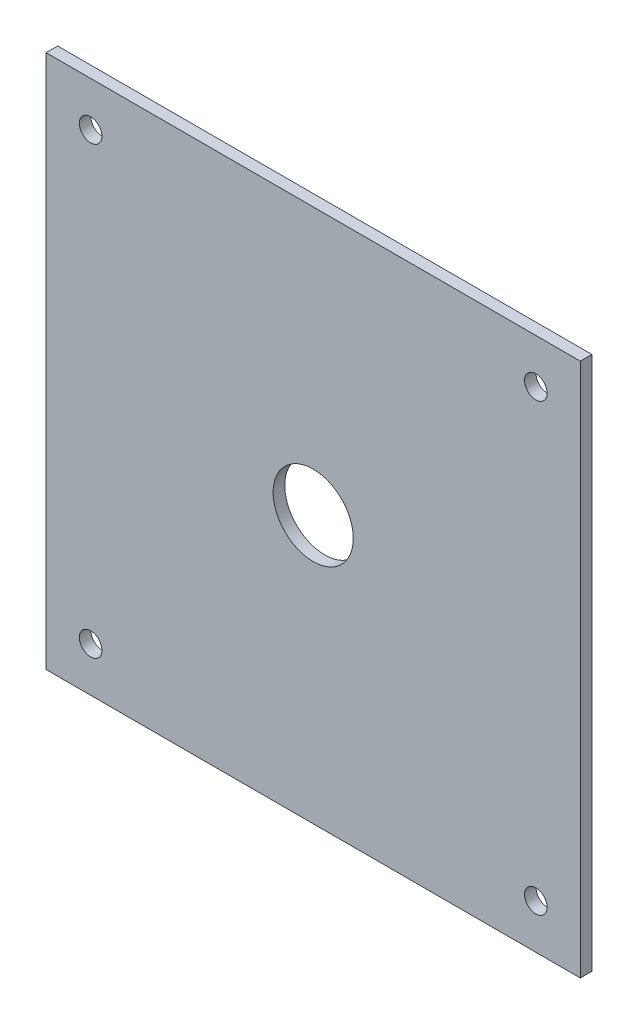
ISO-10303-21;
HEADER;
FILE_DESCRIPTION(('STEP AP214'),'2;1');
FILE_NAME('part.step','',(''),(''),'','','');
FILE_SCHEMA(('AUTOMOTIVE_DESIGN { 1 0 10303 214 1 1 1 1 }'));
ENDSEC;
DATA;
#1=APPLICATION_CONTEXT('core data for automotive mechanical design processes');
#2=APPLICATION_PROTOCOL_DEFINITION('international standard','automotive_design',2000,#1);
#3=PRODUCT_CONTEXT('',#1,'mechanical');
#4=PRODUCT('Part','Part','',(#3));
#5=PRODUCT_RELATED_PRODUCT_CATEGORY('part','',(#4));
#6=PRODUCT_DEFINITION_FORMATION('','',#4);
#7=PRODUCT_DEFINITION_CONTEXT('part definition',#1,'design');
#8=PRODUCT_DEFINITION('design','',#6,#7);
#9=PRODUCT_DEFINITION_SHAPE('','',#8);
#10=(LENGTH_UNIT() NAMED_UNIT(*) SI_UNIT(.MILLI.,.METRE.));
#11=(NAMED_UNIT(*) PLANE_ANGLE_UNIT() SI_UNIT($,.RADIAN.));
#12=(NAMED_UNIT(*) SI_UNIT($,.STERADIAN.) SOLID_ANGLE_UNIT());
#13=UNCERTAINTY_MEASURE_WITH_UNIT(LENGTH_MEASURE(1.E-05),#10,'distance_accuracy_value','');
#14=(GEOMETRIC_REPRESENTATION_CONTEXT(3) GLOBAL_UNCERTAINTY_ASSIGNED_CONTEXT((#13)) GLOBAL_UNIT_ASSIGNED_CONTEXT((#10,
#11,#12)) REPRESENTATION_CONTEXT('',''));
#15=CARTESIAN_POINT('',(0.,0.,0.));
#16=DIRECTION('',(0.,0.,1.));
#17=DIRECTION('',(1.,0.,0.));
#18=AXIS2_PLACEMENT_3D('',#15,#16,#17);
#19=CARTESIAN_POINT('',(0.,0.,3.302));
#20=DIRECTION('',(0.,0.,-1.));
#21=DIRECTION('',(-1.,0.,0.));
#22=AXIS2_PLACEMENT_3D('',#19,#20,#21);
#23=PLANE('',#22);
#24=DIRECTION('',(0.,1.,0.));
#25=VECTOR('',#24,1.);
#26=CARTESIAN_POINT('',(76.2,-76.2,3.302));
#27=LINE('',#26,#25);
#28=CARTESIAN_POINT('',(76.2,-76.2,3.302));
#29=VERTEX_POINT('',#28);
#30=CARTESIAN_POINT('',(76.2,76.2,3.302));
#31=VERTEX_POINT('',#30);
#32=EDGE_CURVE('E98',#29,#31,#27,.T.);
#33=ORIENTED_EDGE('',*,*,#32,.T.);
#34=DIRECTION('',(-1.,0.,0.));
#35=VECTOR('',#34,1.);
#36=CARTESIAN_POINT('',(-76.2,76.2,3.302));
#37=LINE('',#36,#35);
#38=CARTESIAN_POINT('',(-76.2,76.2,3.302));
#39=VERTEX_POINT('',#38);
#40=EDGE_CURVE('E93',#31,#39,#37,.T.);
#41=ORIENTED_EDGE('',*,*,#40,.T.);
#42=DIRECTION('',(0.,-1.,0.));
#43=VECTOR('',#42,1.);
#44=CARTESIAN_POINT('',(-76.2,-76.2,3.302));
#45=LINE('',#44,#43);
#46=CARTESIAN_POINT('',(-76.2,-76.2,3.302));
#47=VERTEX_POINT('',#46);
#48=EDGE_CURVE('E96',#39,#47,#45,.T.);
#49=ORIENTED_EDGE('',*,*,#48,.T.);
#50=DIRECTION('',(1.,0.,0.));
#51=VECTOR('',#50,1.);
#52=CARTESIAN_POINT('',(-76.2,-76.2,3.302));
#53=LINE('',#52,#51);
#54=EDGE_CURVE('E63',#47,#29,#53,.T.);
#55=ORIENTED_EDGE('',*,*,#54,.T.);
#56=EDGE_LOOP('',(#33,#41,#49,#55));
#57=FACE_BOUND('',#56,.T.);
#58=CARTESIAN_POINT('',(0.,0.,3.302));
#59=DIRECTION('',(0.,0.,1.));
#60=DIRECTION('',(1.,0.,0.));
#61=AXIS2_PLACEMENT_3D('',#58,#59,#60);
#62=CIRCLE('',#61,11.43);
#63=CARTESIAN_POINT('',(11.43,0.,3.302));
#64=VERTEX_POINT('',#63);
#65=EDGE_CURVE('E118',#64,#64,#62,.T.);
#66=ORIENTED_EDGE('',*,*,#65,.F.);
#67=EDGE_LOOP('',(#66));
#68=FACE_BOUND('',#67,.T.);
#69=CARTESIAN_POINT('',(-63.5,63.5,3.302));
#70=DIRECTION('',(0.,0.,1.));
#71=DIRECTION('',(1.,0.,0.));
#72=AXIS2_PLACEMENT_3D('',#69,#70,#71);
#73=CIRCLE('',#72,3.2258);
#74=CARTESIAN_POINT('',(-60.2742,63.5,3.302));
#75=VERTEX_POINT('',#74);
#76=EDGE_CURVE('E140',#75,#75,#73,.T.);
#77=ORIENTED_EDGE('',*,*,#76,.F.);
#78=EDGE_LOOP('',(#77));
#79=FACE_BOUND('',#78,.T.);
#80=CARTESIAN_POINT('',(63.5000000000007,63.5000000000004,3.302));
#81=DIRECTION('',(0.,0.,1.));
#82=DIRECTION('',(-1.,0.,0.));
#83=AXIS2_PLACEMENT_3D('',#80,#81,#82);
#84=CIRCLE('',#83,3.22579999999999);
#85=CARTESIAN_POINT('',(60.2742000000007,63.5000000000004,3.302));
#86=VERTEX_POINT('',#85);
#87=EDGE_CURVE('E148',#86,#86,#84,.T.);
#88=ORIENTED_EDGE('',*,*,#87,.F.);
#89=EDGE_LOOP('',(#88));
#90=FACE_BOUND('',#89,.T.);
#91=CARTESIAN_POINT('',(63.5000000000007,-63.5000000000005,3.302));
#92=DIRECTION('',(0.,0.,1.));
#93=DIRECTION('',(1.,0.,0.));
#94=AXIS2_PLACEMENT_3D('',#91,#92,#93);
#95=CIRCLE('',#94,3.22579999999999);
#96=CARTESIAN_POINT('',(66.7258000000007,-63.5000000000005,3.302));
#97=VERTEX_POINT('',#96);
#98=EDGE_CURVE('E156',#97,#97,#95,.T.);
#99=ORIENTED_EDGE('',*,*,#98,.F.);
#100=EDGE_LOOP('',(#99));
#101=FACE_BOUND('',#100,.T.);
#102=CARTESIAN_POINT('',(-63.5,-63.5,3.302));
#103=DIRECTION('',(0.,0.,1.));
#104=DIRECTION('',(-1.,0.,0.));
#105=AXIS2_PLACEMENT_3D('',#102,#103,#104);
#106=CIRCLE('',#105,3.2258);
#107=CARTESIAN_POINT('',(-66.7258,-63.5,3.302));
#108=VERTEX_POINT('',#107);
#109=EDGE_CURVE('E164',#108,#108,#106,.T.);
#110=ORIENTED_EDGE('',*,*,#109,.F.);
#111=EDGE_LOOP('',(#110));
#112=FACE_BOUND('',#111,.T.);
#113=ADVANCED_FACE('F45',(#57,#68,#79,#90,#101,#112),#23,.F.);
#114=CARTESIAN_POINT('',(0.,0.,0.));
#115=DIRECTION('',(0.,0.,-1.));
#116=DIRECTION('',(-1.,0.,0.));
#117=AXIS2_PLACEMENT_3D('',#114,#115,#116);
#118=PLANE('',#117);
#119=CARTESIAN_POINT('',(63.5000000000007,-63.5000000000005,0.));
#120=DIRECTION('',(0.,0.,1.));
#121=DIRECTION('',(1.,0.,0.));
#122=AXIS2_PLACEMENT_3D('',#119,#120,#121);
#123=CIRCLE('',#122,3.22579999999999);
#124=CARTESIAN_POINT('',(66.7258000000007,-63.5000000000005,0.));
#125=VERTEX_POINT('',#124);
#126=EDGE_CURVE('E160',#125,#125,#123,.T.);
#127=ORIENTED_EDGE('',*,*,#126,.T.);
#128=EDGE_LOOP('',(#127));
#129=FACE_BOUND('',#128,.T.);
#130=CARTESIAN_POINT('',(-63.5,63.5,0.));
#131=DIRECTION('',(0.,0.,1.));
#132=DIRECTION('',(1.,0.,0.));
#133=AXIS2_PLACEMENT_3D('',#130,#131,#132);
#134=CIRCLE('',#133,3.2258);
#135=CARTESIAN_POINT('',(-60.2742,63.5,0.));
#136=VERTEX_POINT('',#135);
#137=EDGE_CURVE('E144',#136,#136,#134,.T.);
#138=ORIENTED_EDGE('',*,*,#137,.T.);
#139=EDGE_LOOP('',(#138));
#140=FACE_BOUND('',#139,.T.);
#141=DIRECTION('',(0.,1.,0.));
#142=VECTOR('',#141,1.);
#143=CARTESIAN_POINT('',(76.2,-76.2,0.));
#144=LINE('',#143,#142);
#145=CARTESIAN_POINT('',(76.2,-76.2,0.));
#146=VERTEX_POINT('',#145);
#147=CARTESIAN_POINT('',(76.2,76.2,0.));
#148=VERTEX_POINT('',#147);
#149=EDGE_CURVE('E114',#146,#148,#144,.T.);
#150=ORIENTED_EDGE('',*,*,#149,.F.);
#151=DIRECTION('',(1.,0.,0.));
#152=VECTOR('',#151,1.);
#153=CARTESIAN_POINT('',(-76.2,-76.2,0.));
#154=LINE('',#153,#152);
#155=CARTESIAN_POINT('',(-76.2,-76.2,0.));
#156=VERTEX_POINT('',#155);
#157=EDGE_CURVE('E86',#156,#146,#154,.T.);
#158=ORIENTED_EDGE('',*,*,#157,.F.);
#159=DIRECTION('',(0.,-1.,0.));
#160=VECTOR('',#159,1.);
#161=CARTESIAN_POINT('',(-76.2,-76.2,0.));
#162=LINE('',#161,#160);
#163=CARTESIAN_POINT('',(-76.2,76.2,0.));
#164=VERTEX_POINT('',#163);
#165=EDGE_CURVE('E80',#164,#156,#162,.T.);
#166=ORIENTED_EDGE('',*,*,#165,.F.);
#167=DIRECTION('',(-1.,0.,0.));
#168=VECTOR('',#167,1.);
#169=CARTESIAN_POINT('',(-76.2,76.2,0.));
#170=LINE('',#169,#168);
#171=EDGE_CURVE('E103',#148,#164,#170,.T.);
#172=ORIENTED_EDGE('',*,*,#171,.F.);
#173=EDGE_LOOP('',(#150,#158,#166,#172));
#174=FACE_BOUND('',#173,.T.);
#175=CARTESIAN_POINT('',(0.,0.,0.));
#176=DIRECTION('',(0.,0.,1.));
#177=DIRECTION('',(1.,0.,0.));
#178=AXIS2_PLACEMENT_3D('',#175,#176,#177);
#179=CIRCLE('',#178,11.43);
#180=CARTESIAN_POINT('',(11.43,0.,0.));
#181=VERTEX_POINT('',#180);
#182=EDGE_CURVE('E136',#181,#181,#179,.T.);
#183=ORIENTED_EDGE('',*,*,#182,.T.);
#184=EDGE_LOOP('',(#183));
#185=FACE_BOUND('',#184,.T.);
#186=CARTESIAN_POINT('',(63.5000000000007,63.5000000000004,0.));
#187=DIRECTION('',(0.,0.,1.));
#188=DIRECTION('',(-1.,0.,0.));
#189=AXIS2_PLACEMENT_3D('',#186,#187,#188);
#190=CIRCLE('',#189,3.22579999999999);
#191=CARTESIAN_POINT('',(60.2742000000007,63.5000000000004,0.));
#192=VERTEX_POINT('',#191);
#193=EDGE_CURVE('E152',#192,#192,#190,.T.);
#194=ORIENTED_EDGE('',*,*,#193,.T.);
#195=EDGE_LOOP('',(#194));
#196=FACE_BOUND('',#195,.T.);
#197=CARTESIAN_POINT('',(-63.5,-63.5,0.));
#198=DIRECTION('',(0.,0.,1.));
#199=DIRECTION('',(-1.,0.,0.));
#200=AXIS2_PLACEMENT_3D('',#197,#198,#199);
#201=CIRCLE('',#200,3.2258);
#202=CARTESIAN_POINT('',(-66.7258,-63.5,0.));
#203=VERTEX_POINT('',#202);
#204=EDGE_CURVE('E168',#203,#203,#201,.T.);
#205=ORIENTED_EDGE('',*,*,#204,.T.);
#206=EDGE_LOOP('',(#205));
#207=FACE_BOUND('',#206,.T.);
#208=ADVANCED_FACE('F131',(#129,#140,#174,#185,#196,#207),#118,.T.);
#209=CARTESIAN_POINT('',(76.2,-76.2,3.302));
#210=DIRECTION('',(-1.,0.,0.));
#211=DIRECTION('',(0.,0.,1.));
#212=AXIS2_PLACEMENT_3D('',#209,#210,#211);
#213=PLANE('',#212);
#214=ORIENTED_EDGE('',*,*,#149,.T.);
#215=DIRECTION('',(0.,0.,-1.));
#216=VECTOR('',#215,1.);
#217=CARTESIAN_POINT('',(76.2,76.2,3.302));
#218=LINE('',#217,#216);
#219=EDGE_CURVE('E11',#31,#148,#218,.T.);
#220=ORIENTED_EDGE('',*,*,#219,.F.);
#221=ORIENTED_EDGE('',*,*,#32,.F.);
#222=DIRECTION('',(0.,0.,-1.));
#223=VECTOR('',#222,1.);
#224=CARTESIAN_POINT('',(76.2,-76.2,3.302));
#225=LINE('',#224,#223);
#226=EDGE_CURVE('E110',#29,#146,#225,.T.);
#227=ORIENTED_EDGE('',*,*,#226,.T.);
#228=EDGE_LOOP('',(#214,#220,#221,#227));
#229=FACE_BOUND('',#228,.T.);
#230=ADVANCED_FACE('F47',(#229),#213,.F.);
#231=CARTESIAN_POINT('',(-76.2,76.2,3.302));
#232=DIRECTION('',(0.,-1.,0.));
#233=DIRECTION('',(0.,0.,-1.));
#234=AXIS2_PLACEMENT_3D('',#231,#232,#233);
#235=PLANE('',#234);
#236=ORIENTED_EDGE('',*,*,#171,.T.);
#237=DIRECTION('',(0.,0.,-1.));
#238=VECTOR('',#237,1.);
#239=CARTESIAN_POINT('',(-76.2,76.2,3.302));
#240=LINE('',#239,#238);
#241=EDGE_CURVE('E55',#39,#164,#240,.T.);
#242=ORIENTED_EDGE('',*,*,#241,.F.);
#243=ORIENTED_EDGE('',*,*,#40,.F.);
#244=ORIENTED_EDGE('',*,*,#219,.T.);
#245=EDGE_LOOP('',(#236,#242,#243,#244));
#246=FACE_BOUND('',#245,.T.);
#247=ADVANCED_FACE('F102',(#246),#235,.F.);
#248=CARTESIAN_POINT('',(-76.2,-76.2,3.302));
#249=DIRECTION('',(1.,0.,0.));
#250=DIRECTION('',(0.,0.,-1.));
#251=AXIS2_PLACEMENT_3D('',#248,#249,#250);
#252=PLANE('',#251);
#253=ORIENTED_EDGE('',*,*,#165,.T.);
#254=DIRECTION('',(0.,0.,-1.));
#255=VECTOR('',#254,1.);
#256=CARTESIAN_POINT('',(-76.2,-76.2,3.302));
#257=LINE('',#256,#255);
#258=EDGE_CURVE('E105',#47,#156,#257,.T.);
#259=ORIENTED_EDGE('',*,*,#258,.F.);
#260=ORIENTED_EDGE('',*,*,#48,.F.);
#261=ORIENTED_EDGE('',*,*,#241,.T.);
#262=EDGE_LOOP('',(#253,#259,#260,#261));
#263=FACE_BOUND('',#262,.T.);
#264=ADVANCED_FACE('F106',(#263),#252,.F.);
#265=CARTESIAN_POINT('',(-76.2,-76.2,3.302));
#266=DIRECTION('',(0.,1.,0.));
#267=DIRECTION('',(0.,0.,1.));
#268=AXIS2_PLACEMENT_3D('',#265,#266,#267);
#269=PLANE('',#268);
#270=ORIENTED_EDGE('',*,*,#157,.T.);
#271=ORIENTED_EDGE('',*,*,#226,.F.);
#272=ORIENTED_EDGE('',*,*,#54,.F.);
#273=ORIENTED_EDGE('',*,*,#258,.T.);
#274=EDGE_LOOP('',(#270,#271,#272,#273));
#275=FACE_BOUND('',#274,.T.);
#276=ADVANCED_FACE('F128',(#275),#269,.F.);
#277=CARTESIAN_POINT('',(0.,0.,3.302));
#278=DIRECTION('',(0.,0.,-1.));
#279=DIRECTION('',(-1.,0.,0.));
#280=AXIS2_PLACEMENT_3D('',#277,#278,#279);
#281=CYLINDRICAL_SURFACE('',#280,11.43);
#282=ORIENTED_EDGE('',*,*,#65,.T.);
#283=EDGE_LOOP('',(#282));
#284=FACE_BOUND('',#283,.T.);
#285=ORIENTED_EDGE('',*,*,#182,.F.);
#286=EDGE_LOOP('',(#285));
#287=FACE_BOUND('',#286,.T.);
#288=ADVANCED_FACE('F187',(#284,#287),#281,.F.);
#289=CARTESIAN_POINT('',(-63.5,63.5,3.302));
#290=DIRECTION('',(0.,0.,-1.));
#291=DIRECTION('',(-1.,0.,0.));
#292=AXIS2_PLACEMENT_3D('',#289,#290,#291);
#293=CYLINDRICAL_SURFACE('',#292,3.2258);
#294=ORIENTED_EDGE('',*,*,#76,.T.);
#295=EDGE_LOOP('',(#294));
#296=FACE_BOUND('',#295,.T.);
#297=ORIENTED_EDGE('',*,*,#137,.F.);
#298=EDGE_LOOP('',(#297));
#299=FACE_BOUND('',#298,.T.);
#300=ADVANCED_FACE('F214',(#296,#299),#293,.F.);
#301=CARTESIAN_POINT('',(63.5000000000007,63.5000000000004,3.302));
#302=DIRECTION('',(0.,0.,-1.));
#303=DIRECTION('',(-1.,0.,0.));
#304=AXIS2_PLACEMENT_3D('',#301,#302,#303);
#305=CYLINDRICAL_SURFACE('',#304,3.22579999999999);
#306=ORIENTED_EDGE('',*,*,#87,.T.);
#307=EDGE_LOOP('',(#306));
#308=FACE_BOUND('',#307,.T.);
#309=ORIENTED_EDGE('',*,*,#193,.F.);
#310=EDGE_LOOP('',(#309));
#311=FACE_BOUND('',#310,.T.);
#312=ADVANCED_FACE('F224',(#308,#311),#305,.F.);
#313=CARTESIAN_POINT('',(63.5000000000007,-63.5000000000005,3.302));
#314=DIRECTION('',(0.,0.,-1.));
#315=DIRECTION('',(-1.,0.,0.));
#316=AXIS2_PLACEMENT_3D('',#313,#314,#315);
#317=CYLINDRICAL_SURFACE('',#316,3.22579999999999);
#318=ORIENTED_EDGE('',*,*,#98,.T.);
#319=EDGE_LOOP('',(#318));
#320=FACE_BOUND('',#319,.T.);
#321=ORIENTED_EDGE('',*,*,#126,.F.);
#322=EDGE_LOOP('',(#321));
#323=FACE_BOUND('',#322,.T.);
#324=ADVANCED_FACE('F233',(#320,#323),#317,.F.);
#325=CARTESIAN_POINT('',(-63.5,-63.5,3.302));
#326=DIRECTION('',(0.,0.,-1.));
#327=DIRECTION('',(-1.,0.,0.));
#328=AXIS2_PLACEMENT_3D('',#325,#326,#327);
#329=CYLINDRICAL_SURFACE('',#328,3.2258);
#330=ORIENTED_EDGE('',*,*,#109,.T.);
#331=EDGE_LOOP('',(#330));
#332=FACE_BOUND('',#331,.T.);
#333=ORIENTED_EDGE('',*,*,#204,.F.);
#334=EDGE_LOOP('',(#333));
#335=FACE_BOUND('',#334,.T.);
#336=ADVANCED_FACE('F176',(#332,#335),#329,.F.);
#337=CLOSED_SHELL('',(#113,#208,#230,#247,#264,#276,#288,#300,#312,#324,#336));
#338=MANIFOLD_SOLID_BREP('B2',#337);
#339=ADVANCED_BREP_SHAPE_REPRESENTATION('',(#18,#338),#14);
#340=SHAPE_DEFINITION_REPRESENTATION(#9,#339);
ENDSEC;
END-ISO-10303-21;
